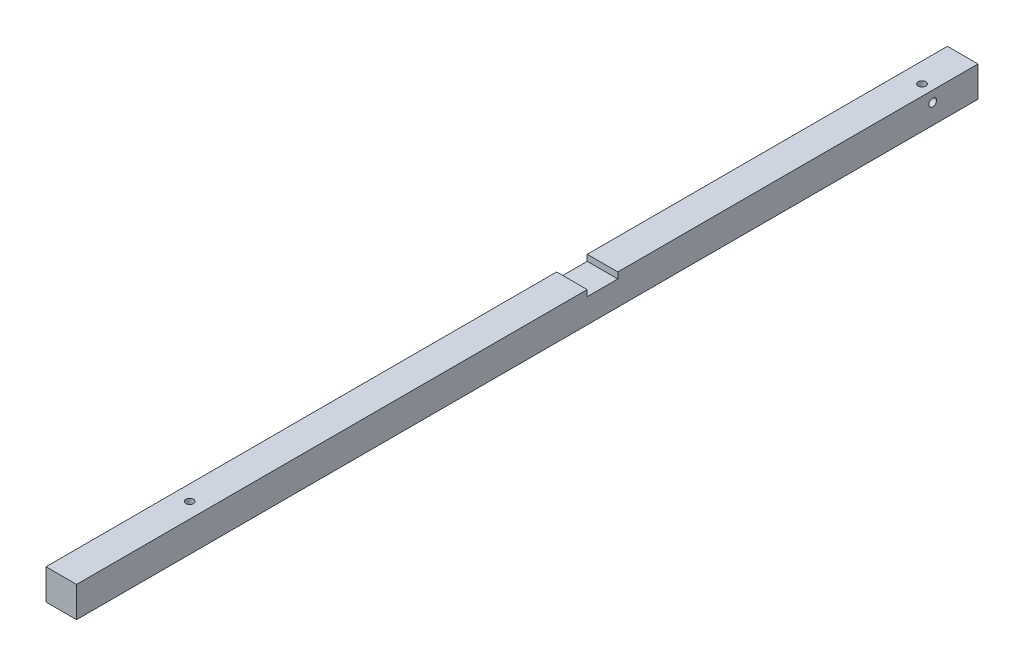
ISO-10303-21;
HEADER;
FILE_DESCRIPTION(('STEP AP214'),'2;1');
FILE_NAME('part.step','',(''),(''),'','','');
FILE_SCHEMA(('AUTOMOTIVE_DESIGN { 1 0 10303 214 1 1 1 1 }'));
ENDSEC;
DATA;
#1=APPLICATION_CONTEXT('core data for automotive mechanical design processes');
#2=APPLICATION_PROTOCOL_DEFINITION('international standard','automotive_design',2000,#1);
#3=PRODUCT_CONTEXT('',#1,'mechanical');
#4=PRODUCT('Part','Part','',(#3));
#5=PRODUCT_RELATED_PRODUCT_CATEGORY('part','',(#4));
#6=PRODUCT_DEFINITION_FORMATION('','',#4);
#7=PRODUCT_DEFINITION_CONTEXT('part definition',#1,'design');
#8=PRODUCT_DEFINITION('design','',#6,#7);
#9=PRODUCT_DEFINITION_SHAPE('','',#8);
#10=(LENGTH_UNIT() NAMED_UNIT(*) SI_UNIT(.MILLI.,.METRE.));
#11=(NAMED_UNIT(*) PLANE_ANGLE_UNIT() SI_UNIT($,.RADIAN.));
#12=(NAMED_UNIT(*) SI_UNIT($,.STERADIAN.) SOLID_ANGLE_UNIT());
#13=UNCERTAINTY_MEASURE_WITH_UNIT(LENGTH_MEASURE(1.E-05),#10,'distance_accuracy_value','');
#14=(GEOMETRIC_REPRESENTATION_CONTEXT(3) GLOBAL_UNCERTAINTY_ASSIGNED_CONTEXT((#13)) GLOBAL_UNIT_ASSIGNED_CONTEXT((#10,
#11,#12)) REPRESENTATION_CONTEXT('',''));
#15=CARTESIAN_POINT('',(0.,0.,0.));
#16=DIRECTION('',(0.,0.,1.));
#17=DIRECTION('',(1.,0.,0.));
#18=AXIS2_PLACEMENT_3D('',#15,#16,#17);
#19=CARTESIAN_POINT('',(1.5,-5.,14.8));
#20=DIRECTION('',(0.,-1.,0.));
#21=DIRECTION('',(0.,0.,-1.));
#22=AXIS2_PLACEMENT_3D('',#19,#20,#21);
#23=CYLINDRICAL_SURFACE('',#22,1.24999999999999);
#24=CARTESIAN_POINT('',(1.5,-4.72499999999999,14.8));
#25=DIRECTION('',(0.,-1.,0.));
#26=DIRECTION('',(0.,0.,-1.));
#27=AXIS2_PLACEMENT_3D('',#24,#25,#26);
#28=CIRCLE('',#27,1.24999999999999);
#29=CARTESIAN_POINT('',(1.5,-4.72499999999999,13.55));
#30=VERTEX_POINT('',#29);
#31=EDGE_CURVE('E197',#30,#30,#28,.T.);
#32=ORIENTED_EDGE('',*,*,#31,.T.);
#33=EDGE_LOOP('',(#32));
#34=FACE_BOUND('',#33,.T.);
#35=CARTESIAN_POINT('',(1.5,1.5,14.8));
#36=DIRECTION('',(0.707106781186547,-0.707106781186547,0.));
#37=DIRECTION('',(-0.707106781186547,-0.707106781186547,0.));
#38=AXIS2_PLACEMENT_3D('',#35,#36,#37);
#39=ELLIPSE('',#38,1.76776695296636,1.24999999999999);
#40=CARTESIAN_POINT('',(1.5,1.5,13.55));
#41=VERTEX_POINT('',#40);
#42=CARTESIAN_POINT('',(1.5,1.5,16.05));
#43=VERTEX_POINT('',#42);
#44=EDGE_CURVE('E53',#41,#43,#39,.F.);
#45=ORIENTED_EDGE('',*,*,#44,.T.);
#46=CARTESIAN_POINT('',(1.5,1.5,14.8));
#47=DIRECTION('',(-0.707106781186547,-0.707106781186547,0.));
#48=DIRECTION('',(0.707106781186547,-0.707106781186547,0.));
#49=AXIS2_PLACEMENT_3D('',#46,#47,#48);
#50=ELLIPSE('',#49,1.76776695296636,1.24999999999999);
#51=EDGE_CURVE('E12',#43,#41,#50,.F.);
#52=ORIENTED_EDGE('',*,*,#51,.T.);
#53=EDGE_LOOP('',(#45,#52));
#54=FACE_BOUND('',#53,.T.);
#55=ADVANCED_FACE('F40',(#34,#54),#23,.F.);
#56=CARTESIAN_POINT('',(-5.,5.,310.942135623731));
#57=DIRECTION('',(0.,-1.,0.));
#58=DIRECTION('',(0.,0.,-1.));
#59=AXIS2_PLACEMENT_3D('',#56,#57,#58);
#60=PLANE('',#59);
#61=CARTESIAN_POINT('',(0.,5.,252.8));
#62=DIRECTION('',(0.,-1.,0.));
#63=DIRECTION('',(0.,0.,-1.));
#64=AXIS2_PLACEMENT_3D('',#61,#62,#63);
#65=CIRCLE('',#64,1.25);
#66=CARTESIAN_POINT('',(0.,5.,251.55));
#67=VERTEX_POINT('',#66);
#68=EDGE_CURVE('E212',#67,#67,#65,.T.);
#69=ORIENTED_EDGE('',*,*,#68,.T.);
#70=EDGE_LOOP('',(#69));
#71=FACE_BOUND('',#70,.T.);
#72=DIRECTION('',(0.,0.,-1.));
#73=VECTOR('',#72,1.);
#74=CARTESIAN_POINT('',(5.,5.,310.942135623731));
#75=LINE('',#74,#73);
#76=CARTESIAN_POINT('',(5.,5.,294.8));
#77=VERTEX_POINT('',#76);
#78=CARTESIAN_POINT('',(5.,5.,127.8));
#79=VERTEX_POINT('',#78);
#80=EDGE_CURVE('E131',#77,#79,#75,.T.);
#81=ORIENTED_EDGE('',*,*,#80,.T.);
#82=DIRECTION('',(-1.,0.,0.));
#83=VECTOR('',#82,1.);
#84=CARTESIAN_POINT('',(5.,5.,127.8));
#85=LINE('',#84,#83);
#86=CARTESIAN_POINT('',(-5.,5.,127.8));
#87=VERTEX_POINT('',#86);
#88=EDGE_CURVE('E171',#79,#87,#85,.T.);
#89=ORIENTED_EDGE('',*,*,#88,.T.);
#90=DIRECTION('',(0.,0.,-1.));
#91=VECTOR('',#90,1.);
#92=CARTESIAN_POINT('',(-5.,5.,310.942135623731));
#93=LINE('',#92,#91);
#94=CARTESIAN_POINT('',(-5.,5.,294.8));
#95=VERTEX_POINT('',#94);
#96=EDGE_CURVE('E126',#95,#87,#93,.T.);
#97=ORIENTED_EDGE('',*,*,#96,.F.);
#98=DIRECTION('',(-1.,0.,0.));
#99=VECTOR('',#98,1.);
#100=CARTESIAN_POINT('',(-5.,5.,294.8));
#101=LINE('',#100,#99);
#102=EDGE_CURVE('E142',#77,#95,#101,.T.);
#103=ORIENTED_EDGE('',*,*,#102,.F.);
#104=EDGE_LOOP('',(#81,#89,#97,#103));
#105=FACE_BOUND('',#104,.T.);
#106=ADVANCED_FACE('F241',(#71,#105),#60,.F.);
#107=CARTESIAN_POINT('',(-5.,5.,310.942135623731));
#108=DIRECTION('',(1.,0.,0.));
#109=DIRECTION('',(0.,1.,0.));
#110=AXIS2_PLACEMENT_3D('',#107,#108,#109);
#111=PLANE('',#110);
#112=CARTESIAN_POINT('',(-5.,1.5,14.8));
#113=DIRECTION('',(-1.,0.,0.));
#114=DIRECTION('',(0.,0.,1.));
#115=AXIS2_PLACEMENT_3D('',#112,#113,#114);
#116=CIRCLE('',#115,1.525);
#117=CARTESIAN_POINT('',(-5.,1.5,16.325));
#118=VERTEX_POINT('',#117);
#119=EDGE_CURVE('E209',#118,#118,#116,.T.);
#120=ORIENTED_EDGE('',*,*,#119,.F.);
#121=EDGE_LOOP('',(#120));
#122=FACE_BOUND('',#121,.T.);
#123=ORIENTED_EDGE('',*,*,#96,.T.);
#124=DIRECTION('',(0.,1.,0.));
#125=VECTOR('',#124,1.);
#126=CARTESIAN_POINT('',(-5.,3.,127.8));
#127=LINE('',#126,#125);
#128=CARTESIAN_POINT('',(-5.,3.,127.8));
#129=VERTEX_POINT('',#128);
#130=EDGE_CURVE('E187',#129,#87,#127,.T.);
#131=ORIENTED_EDGE('',*,*,#130,.F.);
#132=DIRECTION('',(0.,0.,1.));
#133=VECTOR('',#132,1.);
#134=CARTESIAN_POINT('',(-5.,3.,127.8));
#135=LINE('',#134,#133);
#136=CARTESIAN_POINT('',(-5.,3.,117.8));
#137=VERTEX_POINT('',#136);
#138=EDGE_CURVE('E180',#137,#129,#135,.T.);
#139=ORIENTED_EDGE('',*,*,#138,.F.);
#140=DIRECTION('',(0.,-1.,0.));
#141=VECTOR('',#140,1.);
#142=CARTESIAN_POINT('',(-5.,3.,117.8));
#143=LINE('',#142,#141);
#144=CARTESIAN_POINT('',(-5.,5.,117.8));
#145=VERTEX_POINT('',#144);
#146=EDGE_CURVE('E184',#145,#137,#143,.T.);
#147=ORIENTED_EDGE('',*,*,#146,.F.);
#148=CARTESIAN_POINT('',(-5.,5.,0.));
#149=VERTEX_POINT('',#148);
#150=EDGE_CURVE('E130',#145,#149,#93,.T.);
#151=ORIENTED_EDGE('',*,*,#150,.T.);
#152=DIRECTION('',(0.,-1.,0.));
#153=VECTOR('',#152,1.);
#154=CARTESIAN_POINT('',(-5.,5.,0.));
#155=LINE('',#154,#153);
#156=CARTESIAN_POINT('',(-5.,-5.,0.));
#157=VERTEX_POINT('',#156);
#158=EDGE_CURVE('E129',#149,#157,#155,.T.);
#159=ORIENTED_EDGE('',*,*,#158,.T.);
#160=DIRECTION('',(0.,0.,-1.));
#161=VECTOR('',#160,1.);
#162=CARTESIAN_POINT('',(-5.,-5.,310.942135623731));
#163=LINE('',#162,#161);
#164=CARTESIAN_POINT('',(-5.,-5.,294.8));
#165=VERTEX_POINT('',#164);
#166=EDGE_CURVE('E140',#165,#157,#163,.T.);
#167=ORIENTED_EDGE('',*,*,#166,.F.);
#168=DIRECTION('',(0.,-1.,0.));
#169=VECTOR('',#168,1.);
#170=CARTESIAN_POINT('',(-5.,5.,294.8));
#171=LINE('',#170,#169);
#172=EDGE_CURVE('E145',#95,#165,#171,.T.);
#173=ORIENTED_EDGE('',*,*,#172,.F.);
#174=EDGE_LOOP('',(#123,#131,#139,#147,#151,#159,#167,#173));
#175=FACE_BOUND('',#174,.T.);
#176=ADVANCED_FACE('F228',(#122,#175),#111,.F.);
#177=CARTESIAN_POINT('',(-5.,-5.,310.942135623731));
#178=DIRECTION('',(0.,1.,0.));
#179=DIRECTION('',(0.,0.,1.));
#180=AXIS2_PLACEMENT_3D('',#177,#178,#179);
#181=PLANE('',#180);
#182=CARTESIAN_POINT('',(0.,-5.,252.8));
#183=DIRECTION('',(0.,-1.,0.));
#184=DIRECTION('',(0.,0.,-1.));
#185=AXIS2_PLACEMENT_3D('',#182,#183,#184);
#186=CIRCLE('',#185,1.525);
#187=CARTESIAN_POINT('',(0.,-5.,251.275));
#188=VERTEX_POINT('',#187);
#189=EDGE_CURVE('E218',#188,#188,#186,.T.);
#190=ORIENTED_EDGE('',*,*,#189,.F.);
#191=EDGE_LOOP('',(#190));
#192=FACE_BOUND('',#191,.T.);
#193=CARTESIAN_POINT('',(1.5,-5.,14.8));
#194=DIRECTION('',(0.,-1.,0.));
#195=DIRECTION('',(0.,0.,-1.));
#196=AXIS2_PLACEMENT_3D('',#193,#194,#195);
#197=CIRCLE('',#196,1.525);
#198=CARTESIAN_POINT('',(1.5,-5.,13.275));
#199=VERTEX_POINT('',#198);
#200=EDGE_CURVE('E200',#199,#199,#197,.T.);
#201=ORIENTED_EDGE('',*,*,#200,.F.);
#202=EDGE_LOOP('',(#201));
#203=FACE_BOUND('',#202,.T.);
#204=DIRECTION('',(1.,0.,0.));
#205=VECTOR('',#204,1.);
#206=CARTESIAN_POINT('',(-5.,-5.,294.8));
#207=LINE('',#206,#205);
#208=CARTESIAN_POINT('',(5.,-5.,294.8));
#209=VERTEX_POINT('',#208);
#210=EDGE_CURVE('E148',#165,#209,#207,.T.);
#211=ORIENTED_EDGE('',*,*,#210,.F.);
#212=ORIENTED_EDGE('',*,*,#166,.T.);
#213=DIRECTION('',(1.,0.,0.));
#214=VECTOR('',#213,1.);
#215=CARTESIAN_POINT('',(-5.,-5.,0.));
#216=LINE('',#215,#214);
#217=CARTESIAN_POINT('',(5.,-5.,0.));
#218=VERTEX_POINT('',#217);
#219=EDGE_CURVE('E139',#157,#218,#216,.T.);
#220=ORIENTED_EDGE('',*,*,#219,.T.);
#221=DIRECTION('',(0.,0.,-1.));
#222=VECTOR('',#221,1.);
#223=CARTESIAN_POINT('',(5.,-5.,310.942135623731));
#224=LINE('',#223,#222);
#225=EDGE_CURVE('E136',#209,#218,#224,.T.);
#226=ORIENTED_EDGE('',*,*,#225,.F.);
#227=EDGE_LOOP('',(#211,#212,#220,#226));
#228=FACE_BOUND('',#227,.T.);
#229=ADVANCED_FACE('F224',(#192,#203,#228),#181,.F.);
#230=CARTESIAN_POINT('',(5.,5.,310.942135623731));
#231=DIRECTION('',(-1.,0.,0.));
#232=DIRECTION('',(0.,-1.,0.));
#233=AXIS2_PLACEMENT_3D('',#230,#231,#232);
#234=PLANE('',#233);
#235=CARTESIAN_POINT('',(5.,1.5,14.8));
#236=DIRECTION('',(-1.,0.,0.));
#237=DIRECTION('',(0.,0.,1.));
#238=AXIS2_PLACEMENT_3D('',#235,#236,#237);
#239=CIRCLE('',#238,1.25);
#240=CARTESIAN_POINT('',(5.,1.5,16.05));
#241=VERTEX_POINT('',#240);
#242=EDGE_CURVE('E203',#241,#241,#239,.T.);
#243=ORIENTED_EDGE('',*,*,#242,.T.);
#244=EDGE_LOOP('',(#243));
#245=FACE_BOUND('',#244,.T.);
#246=DIRECTION('',(0.,0.,1.));
#247=VECTOR('',#246,1.);
#248=CARTESIAN_POINT('',(5.,3.,127.8));
#249=LINE('',#248,#247);
#250=CARTESIAN_POINT('',(5.,3.,117.8));
#251=VERTEX_POINT('',#250);
#252=CARTESIAN_POINT('',(5.,3.,127.8));
#253=VERTEX_POINT('',#252);
#254=EDGE_CURVE('E175',#251,#253,#249,.T.);
#255=ORIENTED_EDGE('',*,*,#254,.T.);
#256=DIRECTION('',(0.,1.,0.));
#257=VECTOR('',#256,1.);
#258=CARTESIAN_POINT('',(5.,3.,127.8));
#259=LINE('',#258,#257);
#260=EDGE_CURVE('E183',#253,#79,#259,.T.);
#261=ORIENTED_EDGE('',*,*,#260,.T.);
#262=ORIENTED_EDGE('',*,*,#80,.F.);
#263=DIRECTION('',(0.,1.,0.));
#264=VECTOR('',#263,1.);
#265=CARTESIAN_POINT('',(5.,5.,294.8));
#266=LINE('',#265,#264);
#267=EDGE_CURVE('E121',#209,#77,#266,.T.);
#268=ORIENTED_EDGE('',*,*,#267,.F.);
#269=ORIENTED_EDGE('',*,*,#225,.T.);
#270=DIRECTION('',(0.,1.,0.));
#271=VECTOR('',#270,1.);
#272=CARTESIAN_POINT('',(5.,5.,0.));
#273=LINE('',#272,#271);
#274=CARTESIAN_POINT('',(5.,5.,0.));
#275=VERTEX_POINT('',#274);
#276=EDGE_CURVE('E138',#218,#275,#273,.T.);
#277=ORIENTED_EDGE('',*,*,#276,.T.);
#278=CARTESIAN_POINT('',(5.,5.,117.8));
#279=VERTEX_POINT('',#278);
#280=EDGE_CURVE('E135',#279,#275,#75,.T.);
#281=ORIENTED_EDGE('',*,*,#280,.F.);
#282=DIRECTION('',(0.,-1.,0.));
#283=VECTOR('',#282,1.);
#284=CARTESIAN_POINT('',(5.,3.,117.8));
#285=LINE('',#284,#283);
#286=EDGE_CURVE('E61',#279,#251,#285,.T.);
#287=ORIENTED_EDGE('',*,*,#286,.T.);
#288=EDGE_LOOP('',(#255,#261,#262,#268,#269,#277,#281,#287));
#289=FACE_BOUND('',#288,.T.);
#290=ADVANCED_FACE('F227',(#245,#289),#234,.F.);
#291=CARTESIAN_POINT('',(1.5,5.,14.8));
#292=DIRECTION('',(0.,-1.,0.));
#293=DIRECTION('',(0.,0.,-1.));
#294=AXIS2_PLACEMENT_3D('',#291,#292,#293);
#295=CIRCLE('',#294,1.25);
#296=CARTESIAN_POINT('',(1.5,5.,13.55));
#297=VERTEX_POINT('',#296);
#298=EDGE_CURVE('E189',#297,#297,#295,.T.);
#299=ORIENTED_EDGE('',*,*,#298,.T.);
#300=EDGE_LOOP('',(#299));
#301=FACE_BOUND('',#300,.T.);
#302=ORIENTED_EDGE('',*,*,#150,.F.);
#303=DIRECTION('',(-1.,0.,0.));
#304=VECTOR('',#303,1.);
#305=CARTESIAN_POINT('',(5.,5.,117.8));
#306=LINE('',#305,#304);
#307=EDGE_CURVE('E174',#279,#145,#306,.T.);
#308=ORIENTED_EDGE('',*,*,#307,.F.);
#309=ORIENTED_EDGE('',*,*,#280,.T.);
#310=DIRECTION('',(-1.,0.,0.));
#311=VECTOR('',#310,1.);
#312=CARTESIAN_POINT('',(-5.,5.,0.));
#313=LINE('',#312,#311);
#314=EDGE_CURVE('E134',#275,#149,#313,.T.);
#315=ORIENTED_EDGE('',*,*,#314,.T.);
#316=EDGE_LOOP('',(#302,#308,#309,#315));
#317=FACE_BOUND('',#316,.T.);
#318=ADVANCED_FACE('F254',(#301,#317),#60,.F.);
#319=CARTESIAN_POINT('',(0.,0.,0.));
#320=DIRECTION('',(0.,0.,1.));
#321=DIRECTION('',(1.,0.,0.));
#322=AXIS2_PLACEMENT_3D('',#319,#320,#321);
#323=PLANE('',#322);
#324=CARTESIAN_POINT('',(0.,0.,0.));
#325=DIRECTION('',(0.,0.,-1.));
#326=DIRECTION('',(-1.,0.,0.));
#327=AXIS2_PLACEMENT_3D('',#324,#325,#326);
#328=CIRCLE('',#327,1.525);
#329=CARTESIAN_POINT('',(-1.525,0.,0.));
#330=VERTEX_POINT('',#329);
#331=EDGE_CURVE('E167',#330,#330,#328,.T.);
#332=ORIENTED_EDGE('',*,*,#331,.F.);
#333=EDGE_LOOP('',(#332));
#334=FACE_BOUND('',#333,.T.);
#335=ORIENTED_EDGE('',*,*,#158,.F.);
#336=ORIENTED_EDGE('',*,*,#314,.F.);
#337=ORIENTED_EDGE('',*,*,#276,.F.);
#338=ORIENTED_EDGE('',*,*,#219,.F.);
#339=EDGE_LOOP('',(#335,#336,#337,#338));
#340=FACE_BOUND('',#339,.T.);
#341=ADVANCED_FACE('F259',(#334,#340),#323,.F.);
#342=CARTESIAN_POINT('',(-4.99999999999996,-4.99999999999995,294.8));
#343=DIRECTION('',(0.,0.,1.));
#344=DIRECTION('',(0.,-1.,0.));
#345=AXIS2_PLACEMENT_3D('',#342,#343,#344);
#346=PLANE('',#345);
#347=ORIENTED_EDGE('',*,*,#102,.T.);
#348=ORIENTED_EDGE('',*,*,#172,.T.);
#349=ORIENTED_EDGE('',*,*,#210,.T.);
#350=ORIENTED_EDGE('',*,*,#267,.T.);
#351=EDGE_LOOP('',(#347,#348,#349,#350));
#352=FACE_BOUND('',#351,.T.);
#353=ADVANCED_FACE('F42',(#352),#346,.T.);
#354=CARTESIAN_POINT('',(0.,0.,8.5));
#355=DIRECTION('',(0.,0.,-1.));
#356=DIRECTION('',(-1.,0.,0.));
#357=AXIS2_PLACEMENT_3D('',#354,#355,#356);
#358=CONICAL_SURFACE('',#357,1.25,1.02974425867665);
#359=CARTESIAN_POINT('',(0.,0.,9.25107577378445));
#360=VERTEX_POINT('',#359);
#361=VERTEX_LOOP('',#360);
#362=FACE_BOUND('',#361,.T.);
#363=CARTESIAN_POINT('',(0.,0.,8.5));
#364=DIRECTION('',(0.,0.,-1.));
#365=DIRECTION('',(-1.,0.,0.));
#366=AXIS2_PLACEMENT_3D('',#363,#364,#365);
#367=CIRCLE('',#366,1.25);
#368=CARTESIAN_POINT('',(-1.25,0.,8.5));
#369=VERTEX_POINT('',#368);
#370=EDGE_CURVE('E161',#369,#369,#367,.T.);
#371=ORIENTED_EDGE('',*,*,#370,.T.);
#372=EDGE_LOOP('',(#371));
#373=FACE_BOUND('',#372,.T.);
#374=ADVANCED_FACE('F299',(#362,#373),#358,.F.);
#375=CARTESIAN_POINT('',(0.,0.,0.));
#376=DIRECTION('',(0.,0.,-1.));
#377=DIRECTION('',(-1.,0.,0.));
#378=AXIS2_PLACEMENT_3D('',#375,#376,#377);
#379=CYLINDRICAL_SURFACE('',#378,1.25);
#380=ORIENTED_EDGE('',*,*,#370,.F.);
#381=EDGE_LOOP('',(#380));
#382=FACE_BOUND('',#381,.T.);
#383=CARTESIAN_POINT('',(0.,0.,0.275000000000001));
#384=DIRECTION('',(0.,0.,-1.));
#385=DIRECTION('',(-1.,0.,0.));
#386=AXIS2_PLACEMENT_3D('',#383,#384,#385);
#387=CIRCLE('',#386,1.25);
#388=CARTESIAN_POINT('',(-1.25,0.,0.275000000000001));
#389=VERTEX_POINT('',#388);
#390=EDGE_CURVE('E164',#389,#389,#387,.T.);
#391=ORIENTED_EDGE('',*,*,#390,.T.);
#392=EDGE_LOOP('',(#391));
#393=FACE_BOUND('',#392,.T.);
#394=ADVANCED_FACE('F295',(#382,#393),#379,.F.);
#395=CARTESIAN_POINT('',(0.,0.,0.));
#396=DIRECTION('',(0.,0.,-1.));
#397=DIRECTION('',(-1.,0.,0.));
#398=AXIS2_PLACEMENT_3D('',#395,#396,#397);
#399=CONICAL_SURFACE('',#398,1.525,0.78539816339745);
#400=ORIENTED_EDGE('',*,*,#390,.F.);
#401=EDGE_LOOP('',(#400));
#402=FACE_BOUND('',#401,.T.);
#403=ORIENTED_EDGE('',*,*,#331,.T.);
#404=EDGE_LOOP('',(#403));
#405=FACE_BOUND('',#404,.T.);
#406=ADVANCED_FACE('F292',(#402,#405),#399,.F.);
#407=CARTESIAN_POINT('',(5.,3.,127.8));
#408=DIRECTION('',(0.,0.,1.));
#409=DIRECTION('',(1.,0.,0.));
#410=AXIS2_PLACEMENT_3D('',#407,#408,#409);
#411=PLANE('',#410);
#412=ORIENTED_EDGE('',*,*,#130,.T.);
#413=ORIENTED_EDGE('',*,*,#88,.F.);
#414=ORIENTED_EDGE('',*,*,#260,.F.);
#415=DIRECTION('',(-1.,0.,0.));
#416=VECTOR('',#415,1.);
#417=CARTESIAN_POINT('',(5.,3.,127.8));
#418=LINE('',#417,#416);
#419=EDGE_CURVE('E170',#253,#129,#418,.T.);
#420=ORIENTED_EDGE('',*,*,#419,.T.);
#421=EDGE_LOOP('',(#412,#413,#414,#420));
#422=FACE_BOUND('',#421,.T.);
#423=ADVANCED_FACE('F246',(#422),#411,.F.);
#424=CARTESIAN_POINT('',(5.,3.,127.8));
#425=DIRECTION('',(0.,-1.,0.));
#426=DIRECTION('',(0.,0.,-1.));
#427=AXIS2_PLACEMENT_3D('',#424,#425,#426);
#428=PLANE('',#427);
#429=ORIENTED_EDGE('',*,*,#138,.T.);
#430=ORIENTED_EDGE('',*,*,#419,.F.);
#431=ORIENTED_EDGE('',*,*,#254,.F.);
#432=DIRECTION('',(-1.,0.,0.));
#433=VECTOR('',#432,1.);
#434=CARTESIAN_POINT('',(5.,3.,117.8));
#435=LINE('',#434,#433);
#436=EDGE_CURVE('E177',#251,#137,#435,.T.);
#437=ORIENTED_EDGE('',*,*,#436,.T.);
#438=EDGE_LOOP('',(#429,#430,#431,#437));
#439=FACE_BOUND('',#438,.T.);
#440=ADVANCED_FACE('F250',(#439),#428,.F.);
#441=CARTESIAN_POINT('',(5.,3.,117.8));
#442=DIRECTION('',(0.,0.,-1.));
#443=DIRECTION('',(-1.,0.,0.));
#444=AXIS2_PLACEMENT_3D('',#441,#442,#443);
#445=PLANE('',#444);
#446=ORIENTED_EDGE('',*,*,#146,.T.);
#447=ORIENTED_EDGE('',*,*,#436,.F.);
#448=ORIENTED_EDGE('',*,*,#286,.F.);
#449=ORIENTED_EDGE('',*,*,#307,.T.);
#450=EDGE_LOOP('',(#446,#447,#448,#449));
#451=FACE_BOUND('',#450,.T.);
#452=ADVANCED_FACE('F251',(#451),#445,.F.);
#453=CARTESIAN_POINT('',(1.5,1.5,14.8));
#454=DIRECTION('',(0.707106781186547,-0.707106781186547,0.));
#455=DIRECTION('',(-0.707106781186547,-0.707106781186547,0.));
#456=AXIS2_PLACEMENT_3D('',#453,#454,#455);
#457=ELLIPSE('',#456,1.76776695296636,1.24999999999999);
#458=EDGE_CURVE('E114',#41,#43,#457,.T.);
#459=ORIENTED_EDGE('',*,*,#458,.T.);
#460=CARTESIAN_POINT('',(1.5,1.5,14.8));
#461=DIRECTION('',(-0.707106781186547,-0.707106781186547,0.));
#462=DIRECTION('',(0.707106781186547,-0.707106781186547,0.));
#463=AXIS2_PLACEMENT_3D('',#460,#461,#462);
#464=ELLIPSE('',#463,1.76776695296636,1.24999999999999);
#465=EDGE_CURVE('E48',#43,#41,#464,.T.);
#466=ORIENTED_EDGE('',*,*,#465,.T.);
#467=EDGE_LOOP('',(#459,#466));
#468=FACE_BOUND('',#467,.T.);
#469=ORIENTED_EDGE('',*,*,#298,.F.);
#470=EDGE_LOOP('',(#469));
#471=FACE_BOUND('',#470,.T.);
#472=ADVANCED_FACE('F123',(#468,#471),#23,.F.);
#473=CARTESIAN_POINT('',(1.5,-5.,14.8));
#474=DIRECTION('',(0.,-1.,0.));
#475=DIRECTION('',(0.,0.,-1.));
#476=AXIS2_PLACEMENT_3D('',#473,#474,#475);
#477=CONICAL_SURFACE('',#476,1.525,0.785398163397448);
#478=ORIENTED_EDGE('',*,*,#31,.F.);
#479=EDGE_LOOP('',(#478));
#480=FACE_BOUND('',#479,.T.);
#481=ORIENTED_EDGE('',*,*,#200,.T.);
#482=EDGE_LOOP('',(#481));
#483=FACE_BOUND('',#482,.T.);
#484=ADVANCED_FACE('F279',(#480,#483),#477,.F.);
#485=CARTESIAN_POINT('',(-5.,1.5,14.8));
#486=DIRECTION('',(-1.,0.,0.));
#487=DIRECTION('',(0.,0.,1.));
#488=AXIS2_PLACEMENT_3D('',#485,#486,#487);
#489=CYLINDRICAL_SURFACE('',#488,1.24999999999999);
#490=CARTESIAN_POINT('',(-4.72499999999999,1.5,14.8));
#491=DIRECTION('',(-1.,0.,0.));
#492=DIRECTION('',(0.,0.,1.));
#493=AXIS2_PLACEMENT_3D('',#490,#491,#492);
#494=CIRCLE('',#493,1.24999999999999);
#495=CARTESIAN_POINT('',(-4.72499999999999,1.5,16.05));
#496=VERTEX_POINT('',#495);
#497=EDGE_CURVE('E206',#496,#496,#494,.T.);
#498=ORIENTED_EDGE('',*,*,#497,.T.);
#499=EDGE_LOOP('',(#498));
#500=FACE_BOUND('',#499,.T.);
#501=ORIENTED_EDGE('',*,*,#44,.F.);
#502=ORIENTED_EDGE('',*,*,#465,.F.);
#503=EDGE_LOOP('',(#501,#502));
#504=FACE_BOUND('',#503,.T.);
#505=ADVANCED_FACE('F120',(#500,#504),#489,.F.);
#506=CARTESIAN_POINT('',(-5.,1.5,14.8));
#507=DIRECTION('',(-1.,0.,0.));
#508=DIRECTION('',(0.,0.,1.));
#509=AXIS2_PLACEMENT_3D('',#506,#507,#508);
#510=CONICAL_SURFACE('',#509,1.525,0.785398163397448);
#511=ORIENTED_EDGE('',*,*,#497,.F.);
#512=EDGE_LOOP('',(#511));
#513=FACE_BOUND('',#512,.T.);
#514=ORIENTED_EDGE('',*,*,#119,.T.);
#515=EDGE_LOOP('',(#514));
#516=FACE_BOUND('',#515,.T.);
#517=ADVANCED_FACE('F383',(#513,#516),#510,.F.);
#518=ORIENTED_EDGE('',*,*,#242,.F.);
#519=EDGE_LOOP('',(#518));
#520=FACE_BOUND('',#519,.T.);
#521=ORIENTED_EDGE('',*,*,#458,.F.);
#522=ORIENTED_EDGE('',*,*,#51,.F.);
#523=EDGE_LOOP('',(#521,#522));
#524=FACE_BOUND('',#523,.T.);
#525=ADVANCED_FACE('F115',(#520,#524),#489,.F.);
#526=CARTESIAN_POINT('',(0.,-5.,252.8));
#527=DIRECTION('',(0.,-1.,0.));
#528=DIRECTION('',(0.,0.,-1.));
#529=AXIS2_PLACEMENT_3D('',#526,#527,#528);
#530=CYLINDRICAL_SURFACE('',#529,1.24999999999999);
#531=ORIENTED_EDGE('',*,*,#68,.F.);
#532=EDGE_LOOP('',(#531));
#533=FACE_BOUND('',#532,.T.);
#534=CARTESIAN_POINT('',(0.,-4.72499999999999,252.8));
#535=DIRECTION('',(0.,-1.,0.));
#536=DIRECTION('',(0.,0.,-1.));
#537=AXIS2_PLACEMENT_3D('',#534,#535,#536);
#538=CIRCLE('',#537,1.24999999999999);
#539=CARTESIAN_POINT('',(0.,-4.72499999999999,251.55));
#540=VERTEX_POINT('',#539);
#541=EDGE_CURVE('E215',#540,#540,#538,.T.);
#542=ORIENTED_EDGE('',*,*,#541,.T.);
#543=EDGE_LOOP('',(#542));
#544=FACE_BOUND('',#543,.T.);
#545=ADVANCED_FACE('F403',(#533,#544),#530,.F.);
#546=CARTESIAN_POINT('',(0.,-5.,252.8));
#547=DIRECTION('',(0.,-1.,0.));
#548=DIRECTION('',(0.,0.,-1.));
#549=AXIS2_PLACEMENT_3D('',#546,#547,#548);
#550=CONICAL_SURFACE('',#549,1.525,0.785398163397448);
#551=ORIENTED_EDGE('',*,*,#541,.F.);
#552=EDGE_LOOP('',(#551));
#553=FACE_BOUND('',#552,.T.);
#554=ORIENTED_EDGE('',*,*,#189,.T.);
#555=EDGE_LOOP('',(#554));
#556=FACE_BOUND('',#555,.T.);
#557=ADVANCED_FACE('F222',(#553,#556),#550,.F.);
#558=CLOSED_SHELL('',(#55,#106,#176,#229,#290,#318,#341,#353,#374,#394,#406,#423,#440,#452,#472,
#484,#505,#517,#525,#545,#557));
#559=MANIFOLD_SOLID_BREP('B2',#558);
#560=ADVANCED_BREP_SHAPE_REPRESENTATION('',(#18,#559),#14);
#561=SHAPE_DEFINITION_REPRESENTATION(#9,#560);
ENDSEC;
END-ISO-10303-21;
